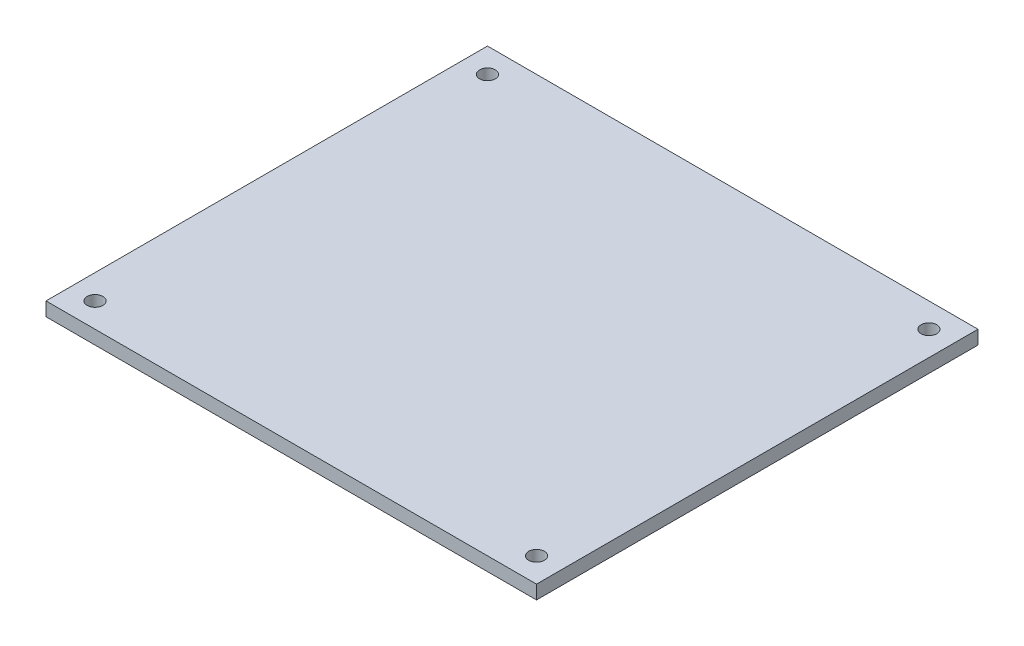
ISO-10303-21;
HEADER;
FILE_DESCRIPTION(('STEP AP214'),'2;1');
FILE_NAME('part.step','',(''),(''),'','','');
FILE_SCHEMA(('AUTOMOTIVE_DESIGN { 1 0 10303 214 1 1 1 1 }'));
ENDSEC;
DATA;
#1=APPLICATION_CONTEXT('core data for automotive mechanical design processes');
#2=APPLICATION_PROTOCOL_DEFINITION('international standard','automotive_design',2000,#1);
#3=PRODUCT_CONTEXT('',#1,'mechanical');
#4=PRODUCT('Part','Part','',(#3));
#5=PRODUCT_RELATED_PRODUCT_CATEGORY('part','',(#4));
#6=PRODUCT_DEFINITION_FORMATION('','',#4);
#7=PRODUCT_DEFINITION_CONTEXT('part definition',#1,'design');
#8=PRODUCT_DEFINITION('design','',#6,#7);
#9=PRODUCT_DEFINITION_SHAPE('','',#8);
#10=(LENGTH_UNIT() NAMED_UNIT(*) SI_UNIT(.MILLI.,.METRE.));
#11=(NAMED_UNIT(*) PLANE_ANGLE_UNIT() SI_UNIT($,.RADIAN.));
#12=(NAMED_UNIT(*) SI_UNIT($,.STERADIAN.) SOLID_ANGLE_UNIT());
#13=UNCERTAINTY_MEASURE_WITH_UNIT(LENGTH_MEASURE(1.E-05),#10,'distance_accuracy_value','');
#14=(GEOMETRIC_REPRESENTATION_CONTEXT(3) GLOBAL_UNCERTAINTY_ASSIGNED_CONTEXT((#13)) GLOBAL_UNIT_ASSIGNED_CONTEXT((#10,
#11,#12)) REPRESENTATION_CONTEXT('',''));
#15=CARTESIAN_POINT('',(0.,0.,0.));
#16=DIRECTION('',(0.,0.,1.));
#17=DIRECTION('',(1.,0.,0.));
#18=AXIS2_PLACEMENT_3D('',#15,#16,#17);
#19=CARTESIAN_POINT('',(0.,2.8,0.));
#20=DIRECTION('',(0.,-1.,0.));
#21=DIRECTION('',(0.,0.,-1.));
#22=AXIS2_PLACEMENT_3D('',#19,#20,#21);
#23=PLANE('',#22);
#24=DIRECTION('',(0.,0.,1.));
#25=VECTOR('',#24,1.);
#26=CARTESIAN_POINT('',(0.,2.8,0.));
#27=LINE('',#26,#25);
#28=CARTESIAN_POINT('',(0.,2.8,-90.));
#29=VERTEX_POINT('',#28);
#30=CARTESIAN_POINT('',(0.,2.8,0.));
#31=VERTEX_POINT('',#30);
#32=EDGE_CURVE('E87',#29,#31,#27,.T.);
#33=ORIENTED_EDGE('',*,*,#32,.T.);
#34=DIRECTION('',(1.,0.,0.));
#35=VECTOR('',#34,1.);
#36=CARTESIAN_POINT('',(0.,2.8,0.));
#37=LINE('',#36,#35);
#38=CARTESIAN_POINT('',(100.,2.8,0.));
#39=VERTEX_POINT('',#38);
#40=EDGE_CURVE('E82',#31,#39,#37,.T.);
#41=ORIENTED_EDGE('',*,*,#40,.T.);
#42=DIRECTION('',(0.,0.,-1.));
#43=VECTOR('',#42,1.);
#44=CARTESIAN_POINT('',(100.,2.8,0.));
#45=LINE('',#44,#43);
#46=CARTESIAN_POINT('',(100.,2.8,-90.));
#47=VERTEX_POINT('',#46);
#48=EDGE_CURVE('E85',#39,#47,#45,.T.);
#49=ORIENTED_EDGE('',*,*,#48,.T.);
#50=DIRECTION('',(-1.,0.,0.));
#51=VECTOR('',#50,1.);
#52=CARTESIAN_POINT('',(0.,2.8,-90.));
#53=LINE('',#52,#51);
#54=EDGE_CURVE('E52',#47,#29,#53,.T.);
#55=ORIENTED_EDGE('',*,*,#54,.T.);
#56=EDGE_LOOP('',(#33,#41,#49,#55));
#57=FACE_BOUND('',#56,.T.);
#58=CARTESIAN_POINT('',(5.,2.8,-85.));
#59=DIRECTION('',(0.,1.,0.));
#60=DIRECTION('',(0.,0.,1.));
#61=AXIS2_PLACEMENT_3D('',#58,#59,#60);
#62=CIRCLE('',#61,1.6);
#63=CARTESIAN_POINT('',(5.,2.8,-83.4));
#64=VERTEX_POINT('',#63);
#65=EDGE_CURVE('E102',#64,#64,#62,.T.);
#66=ORIENTED_EDGE('',*,*,#65,.F.);
#67=EDGE_LOOP('',(#66));
#68=FACE_BOUND('',#67,.T.);
#69=CARTESIAN_POINT('',(95.,2.8,-85.));
#70=DIRECTION('',(0.,1.,0.));
#71=DIRECTION('',(0.,0.,-1.));
#72=AXIS2_PLACEMENT_3D('',#69,#70,#71);
#73=CIRCLE('',#72,1.60000000000001);
#74=CARTESIAN_POINT('',(95.,2.8,-86.6));
#75=VERTEX_POINT('',#74);
#76=EDGE_CURVE('E117',#75,#75,#73,.T.);
#77=ORIENTED_EDGE('',*,*,#76,.F.);
#78=EDGE_LOOP('',(#77));
#79=FACE_BOUND('',#78,.T.);
#80=CARTESIAN_POINT('',(95.,2.8,-4.99999999999998));
#81=DIRECTION('',(0.,1.,0.));
#82=DIRECTION('',(0.,0.,1.));
#83=AXIS2_PLACEMENT_3D('',#80,#81,#82);
#84=CIRCLE('',#83,1.60000000000001);
#85=CARTESIAN_POINT('',(95.,2.8,-3.39999999999997));
#86=VERTEX_POINT('',#85);
#87=EDGE_CURVE('E123',#86,#86,#84,.T.);
#88=ORIENTED_EDGE('',*,*,#87,.F.);
#89=EDGE_LOOP('',(#88));
#90=FACE_BOUND('',#89,.T.);
#91=CARTESIAN_POINT('',(5.,2.8,-4.99999999999998));
#92=DIRECTION('',(0.,1.,0.));
#93=DIRECTION('',(0.,0.,-1.));
#94=AXIS2_PLACEMENT_3D('',#91,#92,#93);
#95=CIRCLE('',#94,1.6);
#96=CARTESIAN_POINT('',(5.,2.8,-6.59999999999998));
#97=VERTEX_POINT('',#96);
#98=EDGE_CURVE('E129',#97,#97,#95,.T.);
#99=ORIENTED_EDGE('',*,*,#98,.F.);
#100=EDGE_LOOP('',(#99));
#101=FACE_BOUND('',#100,.T.);
#102=ADVANCED_FACE('F35',(#57,#68,#79,#90,#101),#23,.F.);
#103=CARTESIAN_POINT('',(0.,0.,0.));
#104=DIRECTION('',(0.,-1.,0.));
#105=DIRECTION('',(0.,0.,-1.));
#106=AXIS2_PLACEMENT_3D('',#103,#104,#105);
#107=PLANE('',#106);
#108=CARTESIAN_POINT('',(95.,0.,-4.99999999999998));
#109=DIRECTION('',(0.,1.,0.));
#110=DIRECTION('',(0.,0.,1.));
#111=AXIS2_PLACEMENT_3D('',#108,#109,#110);
#112=CIRCLE('',#111,1.60000000000001);
#113=CARTESIAN_POINT('',(95.,0.,-3.39999999999997));
#114=VERTEX_POINT('',#113);
#115=EDGE_CURVE('E126',#114,#114,#112,.T.);
#116=ORIENTED_EDGE('',*,*,#115,.T.);
#117=EDGE_LOOP('',(#116));
#118=FACE_BOUND('',#117,.T.);
#119=CARTESIAN_POINT('',(5.,0.,-85.));
#120=DIRECTION('',(0.,1.,0.));
#121=DIRECTION('',(0.,0.,1.));
#122=AXIS2_PLACEMENT_3D('',#119,#120,#121);
#123=CIRCLE('',#122,1.6);
#124=CARTESIAN_POINT('',(5.,0.,-83.4));
#125=VERTEX_POINT('',#124);
#126=EDGE_CURVE('E114',#125,#125,#123,.T.);
#127=ORIENTED_EDGE('',*,*,#126,.T.);
#128=EDGE_LOOP('',(#127));
#129=FACE_BOUND('',#128,.T.);
#130=DIRECTION('',(0.,0.,1.));
#131=VECTOR('',#130,1.);
#132=CARTESIAN_POINT('',(0.,0.,0.));
#133=LINE('',#132,#131);
#134=CARTESIAN_POINT('',(0.,0.,-90.));
#135=VERTEX_POINT('',#134);
#136=CARTESIAN_POINT('',(0.,0.,0.));
#137=VERTEX_POINT('',#136);
#138=EDGE_CURVE('E99',#135,#137,#133,.T.);
#139=ORIENTED_EDGE('',*,*,#138,.F.);
#140=DIRECTION('',(-1.,0.,0.));
#141=VECTOR('',#140,1.);
#142=CARTESIAN_POINT('',(0.,0.,-90.));
#143=LINE('',#142,#141);
#144=CARTESIAN_POINT('',(100.,0.,-90.));
#145=VERTEX_POINT('',#144);
#146=EDGE_CURVE('E75',#145,#135,#143,.T.);
#147=ORIENTED_EDGE('',*,*,#146,.F.);
#148=DIRECTION('',(0.,0.,-1.));
#149=VECTOR('',#148,1.);
#150=CARTESIAN_POINT('',(100.,0.,0.));
#151=LINE('',#150,#149);
#152=CARTESIAN_POINT('',(100.,0.,0.));
#153=VERTEX_POINT('',#152);
#154=EDGE_CURVE('E69',#153,#145,#151,.T.);
#155=ORIENTED_EDGE('',*,*,#154,.F.);
#156=DIRECTION('',(1.,0.,0.));
#157=VECTOR('',#156,1.);
#158=CARTESIAN_POINT('',(0.,0.,0.));
#159=LINE('',#158,#157);
#160=EDGE_CURVE('E91',#137,#153,#159,.T.);
#161=ORIENTED_EDGE('',*,*,#160,.F.);
#162=EDGE_LOOP('',(#139,#147,#155,#161));
#163=FACE_BOUND('',#162,.T.);
#164=CARTESIAN_POINT('',(95.,0.,-85.));
#165=DIRECTION('',(0.,1.,0.));
#166=DIRECTION('',(0.,0.,-1.));
#167=AXIS2_PLACEMENT_3D('',#164,#165,#166);
#168=CIRCLE('',#167,1.60000000000001);
#169=CARTESIAN_POINT('',(95.,0.,-86.6));
#170=VERTEX_POINT('',#169);
#171=EDGE_CURVE('E120',#170,#170,#168,.T.);
#172=ORIENTED_EDGE('',*,*,#171,.T.);
#173=EDGE_LOOP('',(#172));
#174=FACE_BOUND('',#173,.T.);
#175=CARTESIAN_POINT('',(5.,0.,-4.99999999999998));
#176=DIRECTION('',(0.,1.,0.));
#177=DIRECTION('',(0.,0.,-1.));
#178=AXIS2_PLACEMENT_3D('',#175,#176,#177);
#179=CIRCLE('',#178,1.6);
#180=CARTESIAN_POINT('',(5.,0.,-6.59999999999998));
#181=VERTEX_POINT('',#180);
#182=EDGE_CURVE('E132',#181,#181,#179,.T.);
#183=ORIENTED_EDGE('',*,*,#182,.T.);
#184=EDGE_LOOP('',(#183));
#185=FACE_BOUND('',#184,.T.);
#186=ADVANCED_FACE('F110',(#118,#129,#163,#174,#185),#107,.T.);
#187=CARTESIAN_POINT('',(0.,2.8,0.));
#188=DIRECTION('',(1.,0.,0.));
#189=DIRECTION('',(0.,0.,-1.));
#190=AXIS2_PLACEMENT_3D('',#187,#188,#189);
#191=PLANE('',#190);
#192=ORIENTED_EDGE('',*,*,#138,.T.);
#193=DIRECTION('',(0.,-1.,0.));
#194=VECTOR('',#193,1.);
#195=CARTESIAN_POINT('',(0.,2.8,0.));
#196=LINE('',#195,#194);
#197=EDGE_CURVE('E11',#31,#137,#196,.T.);
#198=ORIENTED_EDGE('',*,*,#197,.F.);
#199=ORIENTED_EDGE('',*,*,#32,.F.);
#200=DIRECTION('',(0.,-1.,0.));
#201=VECTOR('',#200,1.);
#202=CARTESIAN_POINT('',(0.,2.8,-90.));
#203=LINE('',#202,#201);
#204=EDGE_CURVE('E95',#29,#135,#203,.T.);
#205=ORIENTED_EDGE('',*,*,#204,.T.);
#206=EDGE_LOOP('',(#192,#198,#199,#205));
#207=FACE_BOUND('',#206,.T.);
#208=ADVANCED_FACE('F37',(#207),#191,.F.);
#209=CARTESIAN_POINT('',(0.,2.8,0.));
#210=DIRECTION('',(0.,0.,-1.));
#211=DIRECTION('',(-1.,0.,0.));
#212=AXIS2_PLACEMENT_3D('',#209,#210,#211);
#213=PLANE('',#212);
#214=ORIENTED_EDGE('',*,*,#160,.T.);
#215=DIRECTION('',(0.,-1.,0.));
#216=VECTOR('',#215,1.);
#217=CARTESIAN_POINT('',(100.,2.8,0.));
#218=LINE('',#217,#216);
#219=EDGE_CURVE('E44',#39,#153,#218,.T.);
#220=ORIENTED_EDGE('',*,*,#219,.F.);
#221=ORIENTED_EDGE('',*,*,#40,.F.);
#222=ORIENTED_EDGE('',*,*,#197,.T.);
#223=EDGE_LOOP('',(#214,#220,#221,#222));
#224=FACE_BOUND('',#223,.T.);
#225=ADVANCED_FACE('F90',(#224),#213,.F.);
#226=CARTESIAN_POINT('',(100.,2.8,0.));
#227=DIRECTION('',(-1.,0.,0.));
#228=DIRECTION('',(0.,0.,1.));
#229=AXIS2_PLACEMENT_3D('',#226,#227,#228);
#230=PLANE('',#229);
#231=ORIENTED_EDGE('',*,*,#154,.T.);
#232=DIRECTION('',(0.,-1.,0.));
#233=VECTOR('',#232,1.);
#234=CARTESIAN_POINT('',(100.,2.8,-90.));
#235=LINE('',#234,#233);
#236=EDGE_CURVE('E92',#47,#145,#235,.T.);
#237=ORIENTED_EDGE('',*,*,#236,.F.);
#238=ORIENTED_EDGE('',*,*,#48,.F.);
#239=ORIENTED_EDGE('',*,*,#219,.T.);
#240=EDGE_LOOP('',(#231,#237,#238,#239));
#241=FACE_BOUND('',#240,.T.);
#242=ADVANCED_FACE('F93',(#241),#230,.F.);
#243=CARTESIAN_POINT('',(0.,2.8,-90.));
#244=DIRECTION('',(0.,0.,1.));
#245=DIRECTION('',(1.,0.,0.));
#246=AXIS2_PLACEMENT_3D('',#243,#244,#245);
#247=PLANE('',#246);
#248=ORIENTED_EDGE('',*,*,#146,.T.);
#249=ORIENTED_EDGE('',*,*,#204,.F.);
#250=ORIENTED_EDGE('',*,*,#54,.F.);
#251=ORIENTED_EDGE('',*,*,#236,.T.);
#252=EDGE_LOOP('',(#248,#249,#250,#251));
#253=FACE_BOUND('',#252,.T.);
#254=ADVANCED_FACE('F107',(#253),#247,.F.);
#255=CARTESIAN_POINT('',(5.,2.8,-85.));
#256=DIRECTION('',(0.,-1.,0.));
#257=DIRECTION('',(0.,0.,-1.));
#258=AXIS2_PLACEMENT_3D('',#255,#256,#257);
#259=CYLINDRICAL_SURFACE('',#258,1.6);
#260=ORIENTED_EDGE('',*,*,#65,.T.);
#261=EDGE_LOOP('',(#260));
#262=FACE_BOUND('',#261,.T.);
#263=ORIENTED_EDGE('',*,*,#126,.F.);
#264=EDGE_LOOP('',(#263));
#265=FACE_BOUND('',#264,.T.);
#266=ADVANCED_FACE('F149',(#262,#265),#259,.F.);
#267=CARTESIAN_POINT('',(95.,2.8,-85.));
#268=DIRECTION('',(0.,-1.,0.));
#269=DIRECTION('',(0.,0.,-1.));
#270=AXIS2_PLACEMENT_3D('',#267,#268,#269);
#271=CYLINDRICAL_SURFACE('',#270,1.60000000000001);
#272=ORIENTED_EDGE('',*,*,#76,.T.);
#273=EDGE_LOOP('',(#272));
#274=FACE_BOUND('',#273,.T.);
#275=ORIENTED_EDGE('',*,*,#171,.F.);
#276=EDGE_LOOP('',(#275));
#277=FACE_BOUND('',#276,.T.);
#278=ADVANCED_FACE('F195',(#274,#277),#271,.F.);
#279=CARTESIAN_POINT('',(95.,2.8,-4.99999999999998));
#280=DIRECTION('',(0.,-1.,0.));
#281=DIRECTION('',(0.,0.,-1.));
#282=AXIS2_PLACEMENT_3D('',#279,#280,#281);
#283=CYLINDRICAL_SURFACE('',#282,1.60000000000001);
#284=ORIENTED_EDGE('',*,*,#87,.T.);
#285=EDGE_LOOP('',(#284));
#286=FACE_BOUND('',#285,.T.);
#287=ORIENTED_EDGE('',*,*,#115,.F.);
#288=EDGE_LOOP('',(#287));
#289=FACE_BOUND('',#288,.T.);
#290=ADVANCED_FACE('F203',(#286,#289),#283,.F.);
#291=CARTESIAN_POINT('',(5.,2.8,-4.99999999999998));
#292=DIRECTION('',(0.,-1.,0.));
#293=DIRECTION('',(0.,0.,-1.));
#294=AXIS2_PLACEMENT_3D('',#291,#292,#293);
#295=CYLINDRICAL_SURFACE('',#294,1.6);
#296=ORIENTED_EDGE('',*,*,#98,.T.);
#297=EDGE_LOOP('',(#296));
#298=FACE_BOUND('',#297,.T.);
#299=ORIENTED_EDGE('',*,*,#182,.F.);
#300=EDGE_LOOP('',(#299));
#301=FACE_BOUND('',#300,.T.);
#302=ADVANCED_FACE('F138',(#298,#301),#295,.F.);
#303=CLOSED_SHELL('',(#102,#186,#208,#225,#242,#254,#266,#278,#290,#302));
#304=MANIFOLD_SOLID_BREP('B2',#303);
#305=ADVANCED_BREP_SHAPE_REPRESENTATION('',(#18,#304),#14);
#306=SHAPE_DEFINITION_REPRESENTATION(#9,#305);
ENDSEC;
END-ISO-10303-21;
